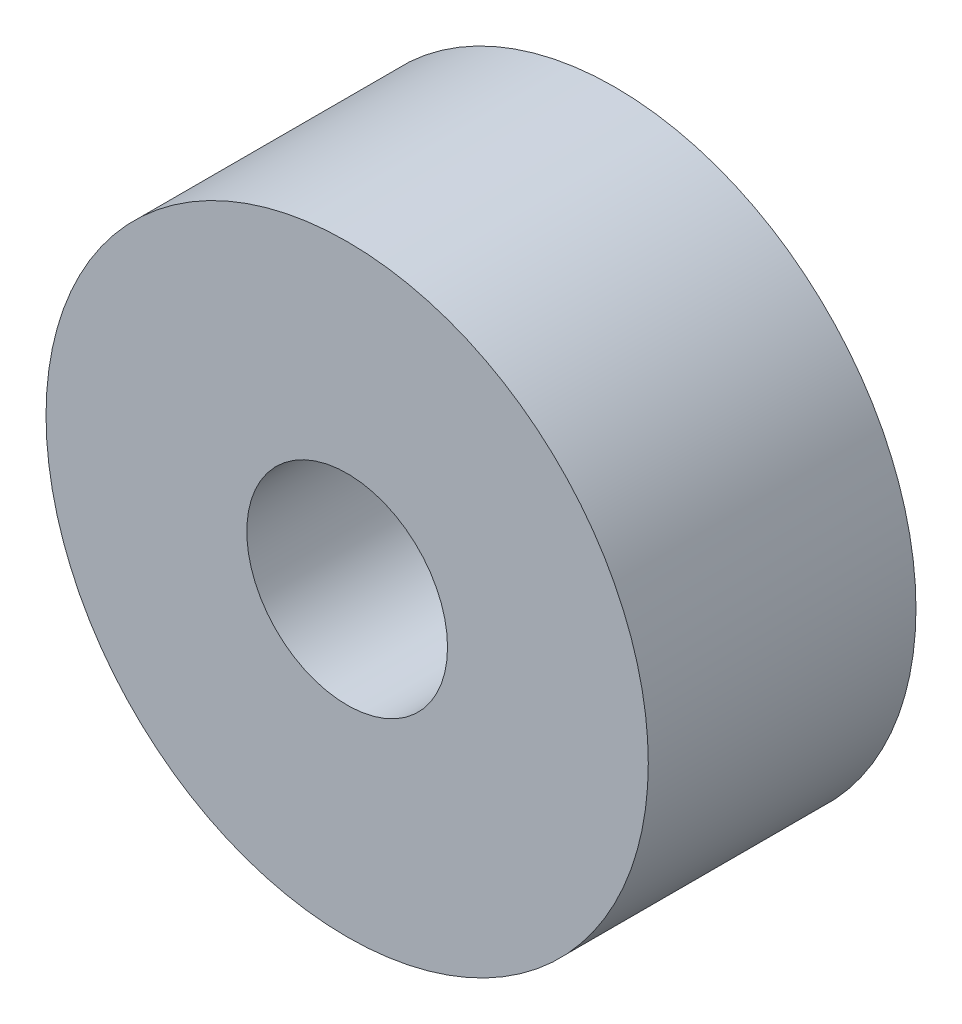
ISO-10303-21;
HEADER;
FILE_DESCRIPTION(('STEP AP214'),'2;1');
FILE_NAME('part.step','',(''),(''),'','','');
FILE_SCHEMA(('AUTOMOTIVE_DESIGN { 1 0 10303 214 1 1 1 1 }'));
ENDSEC;
DATA;
#1=APPLICATION_CONTEXT('core data for automotive mechanical design processes');
#2=APPLICATION_PROTOCOL_DEFINITION('international standard','automotive_design',2000,#1);
#3=PRODUCT_CONTEXT('',#1,'mechanical');
#4=PRODUCT('Part','Part','',(#3));
#5=PRODUCT_RELATED_PRODUCT_CATEGORY('part','',(#4));
#6=PRODUCT_DEFINITION_FORMATION('','',#4);
#7=PRODUCT_DEFINITION_CONTEXT('part definition',#1,'design');
#8=PRODUCT_DEFINITION('design','',#6,#7);
#9=PRODUCT_DEFINITION_SHAPE('','',#8);
#10=(LENGTH_UNIT() NAMED_UNIT(*) SI_UNIT(.MILLI.,.METRE.));
#11=(NAMED_UNIT(*) PLANE_ANGLE_UNIT() SI_UNIT($,.RADIAN.));
#12=(NAMED_UNIT(*) SI_UNIT($,.STERADIAN.) SOLID_ANGLE_UNIT());
#13=UNCERTAINTY_MEASURE_WITH_UNIT(LENGTH_MEASURE(1.E-05),#10,'distance_accuracy_value','');
#14=(GEOMETRIC_REPRESENTATION_CONTEXT(3) GLOBAL_UNCERTAINTY_ASSIGNED_CONTEXT((#13)) GLOBAL_UNIT_ASSIGNED_CONTEXT((#10,
#11,#12)) REPRESENTATION_CONTEXT('',''));
#15=CARTESIAN_POINT('',(0.,0.,0.));
#16=DIRECTION('',(0.,0.,1.));
#17=DIRECTION('',(1.,0.,0.));
#18=AXIS2_PLACEMENT_3D('',#15,#16,#17);
#19=CARTESIAN_POINT('',(0.,0.,4.));
#20=DIRECTION('',(0.,0.,1.));
#21=DIRECTION('',(1.,0.,0.));
#22=AXIS2_PLACEMENT_3D('',#19,#20,#21);
#23=PLANE('',#22);
#24=CARTESIAN_POINT('',(0.,0.,4.));
#25=DIRECTION('',(0.,0.,1.));
#26=DIRECTION('',(1.,0.,0.));
#27=AXIS2_PLACEMENT_3D('',#24,#25,#26);
#28=CIRCLE('',#27,4.5);
#29=CARTESIAN_POINT('',(4.5,0.,4.));
#30=VERTEX_POINT('',#29);
#31=EDGE_CURVE('E10',#30,#30,#28,.T.);
#32=ORIENTED_EDGE('',*,*,#31,.T.);
#33=EDGE_LOOP('',(#32));
#34=FACE_BOUND('',#33,.T.);
#35=CARTESIAN_POINT('',(0.,0.,4.));
#36=DIRECTION('',(0.,0.,1.));
#37=DIRECTION('',(1.,0.,0.));
#38=AXIS2_PLACEMENT_3D('',#35,#36,#37);
#39=CIRCLE('',#38,1.5);
#40=CARTESIAN_POINT('',(1.5,0.,4.));
#41=VERTEX_POINT('',#40);
#42=EDGE_CURVE('E46',#41,#41,#39,.T.);
#43=ORIENTED_EDGE('',*,*,#42,.F.);
#44=EDGE_LOOP('',(#43));
#45=FACE_BOUND('',#44,.T.);
#46=ADVANCED_FACE('F35',(#34,#45),#23,.T.);
#47=CARTESIAN_POINT('',(0.,0.,0.));
#48=DIRECTION('',(0.,0.,1.));
#49=DIRECTION('',(1.,0.,0.));
#50=AXIS2_PLACEMENT_3D('',#47,#48,#49);
#51=PLANE('',#50);
#52=CARTESIAN_POINT('',(0.,0.,0.));
#53=DIRECTION('',(0.,0.,1.));
#54=DIRECTION('',(1.,0.,0.));
#55=AXIS2_PLACEMENT_3D('',#52,#53,#54);
#56=CIRCLE('',#55,4.5);
#57=CARTESIAN_POINT('',(4.5,0.,0.));
#58=VERTEX_POINT('',#57);
#59=EDGE_CURVE('E39',#58,#58,#56,.T.);
#60=ORIENTED_EDGE('',*,*,#59,.F.);
#61=EDGE_LOOP('',(#60));
#62=FACE_BOUND('',#61,.T.);
#63=CARTESIAN_POINT('',(0.,0.,0.));
#64=DIRECTION('',(0.,0.,1.));
#65=DIRECTION('',(1.,0.,0.));
#66=AXIS2_PLACEMENT_3D('',#63,#64,#65);
#67=CIRCLE('',#66,1.5);
#68=CARTESIAN_POINT('',(1.5,0.,0.));
#69=VERTEX_POINT('',#68);
#70=EDGE_CURVE('E48',#69,#69,#67,.T.);
#71=ORIENTED_EDGE('',*,*,#70,.T.);
#72=EDGE_LOOP('',(#71));
#73=FACE_BOUND('',#72,.T.);
#74=ADVANCED_FACE('F58',(#62,#73),#51,.F.);
#75=CARTESIAN_POINT('',(0.,0.,4.));
#76=DIRECTION('',(0.,0.,-1.));
#77=DIRECTION('',(-1.,0.,0.));
#78=AXIS2_PLACEMENT_3D('',#75,#76,#77);
#79=CYLINDRICAL_SURFACE('',#78,4.5);
#80=ORIENTED_EDGE('',*,*,#31,.F.);
#81=EDGE_LOOP('',(#80));
#82=FACE_BOUND('',#81,.T.);
#83=ORIENTED_EDGE('',*,*,#59,.T.);
#84=EDGE_LOOP('',(#83));
#85=FACE_BOUND('',#84,.T.);
#86=ADVANCED_FACE('F37',(#82,#85),#79,.T.);
#87=CARTESIAN_POINT('',(0.,0.,4.));
#88=DIRECTION('',(0.,0.,-1.));
#89=DIRECTION('',(-1.,0.,0.));
#90=AXIS2_PLACEMENT_3D('',#87,#88,#89);
#91=CYLINDRICAL_SURFACE('',#90,1.5);
#92=ORIENTED_EDGE('',*,*,#42,.T.);
#93=EDGE_LOOP('',(#92));
#94=FACE_BOUND('',#93,.T.);
#95=ORIENTED_EDGE('',*,*,#70,.F.);
#96=EDGE_LOOP('',(#95));
#97=FACE_BOUND('',#96,.T.);
#98=ADVANCED_FACE('F54',(#94,#97),#91,.F.);
#99=CLOSED_SHELL('',(#46,#74,#86,#98));
#100=MANIFOLD_SOLID_BREP('B2',#99);
#101=ADVANCED_BREP_SHAPE_REPRESENTATION('',(#18,#100),#14);
#102=SHAPE_DEFINITION_REPRESENTATION(#9,#101);
ENDSEC;
END-ISO-10303-21;
